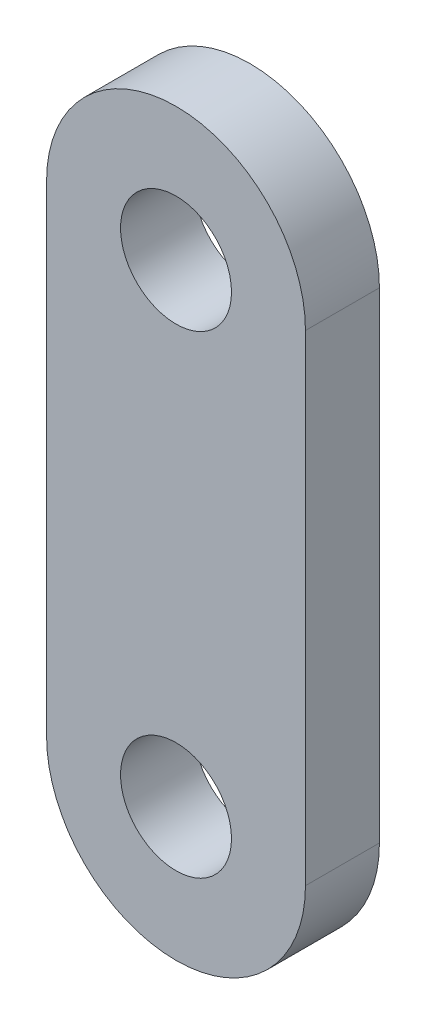
ISO-10303-21;
HEADER;
FILE_DESCRIPTION(('STEP AP214'),'2;1');
FILE_NAME('part.step','',(''),(''),'','','');
FILE_SCHEMA(('AUTOMOTIVE_DESIGN { 1 0 10303 214 1 1 1 1 }'));
ENDSEC;
DATA;
#1=APPLICATION_CONTEXT('core data for automotive mechanical design processes');
#2=APPLICATION_PROTOCOL_DEFINITION('international standard','automotive_design',2000,#1);
#3=PRODUCT_CONTEXT('',#1,'mechanical');
#4=PRODUCT('Part','Part','',(#3));
#5=PRODUCT_RELATED_PRODUCT_CATEGORY('part','',(#4));
#6=PRODUCT_DEFINITION_FORMATION('','',#4);
#7=PRODUCT_DEFINITION_CONTEXT('part definition',#1,'design');
#8=PRODUCT_DEFINITION('design','',#6,#7);
#9=PRODUCT_DEFINITION_SHAPE('','',#8);
#10=(LENGTH_UNIT() NAMED_UNIT(*) SI_UNIT(.MILLI.,.METRE.));
#11=(NAMED_UNIT(*) PLANE_ANGLE_UNIT() SI_UNIT($,.RADIAN.));
#12=(NAMED_UNIT(*) SI_UNIT($,.STERADIAN.) SOLID_ANGLE_UNIT());
#13=UNCERTAINTY_MEASURE_WITH_UNIT(LENGTH_MEASURE(1.E-05),#10,'distance_accuracy_value','');
#14=(GEOMETRIC_REPRESENTATION_CONTEXT(3) GLOBAL_UNCERTAINTY_ASSIGNED_CONTEXT((#13)) GLOBAL_UNIT_ASSIGNED_CONTEXT((#10,
#11,#12)) REPRESENTATION_CONTEXT('',''));
#15=CARTESIAN_POINT('',(0.,0.,0.));
#16=DIRECTION('',(0.,0.,1.));
#17=DIRECTION('',(1.,0.,0.));
#18=AXIS2_PLACEMENT_3D('',#15,#16,#17);
#19=CARTESIAN_POINT('',(0.,-10.31875,-1.5875));
#20=DIRECTION('',(0.,0.,-1.));
#21=DIRECTION('',(-1.,0.,0.));
#22=AXIS2_PLACEMENT_3D('',#19,#20,#21);
#23=CYLINDRICAL_SURFACE('',#22,5.55625);
#24=DIRECTION('',(0.,0.,-1.));
#25=VECTOR('',#24,1.);
#26=CARTESIAN_POINT('',(-5.55625,-10.31875,1.5875));
#27=LINE('',#26,#25);
#28=CARTESIAN_POINT('',(-5.55625,-10.31875,-1.5875));
#29=VERTEX_POINT('',#28);
#30=CARTESIAN_POINT('',(-5.55625,-10.31875,1.5875));
#31=VERTEX_POINT('',#30);
#32=EDGE_CURVE('E86',#29,#31,#27,.F.);
#33=ORIENTED_EDGE('',*,*,#32,.F.);
#34=CARTESIAN_POINT('',(0.,-10.31875,-1.5875));
#35=DIRECTION('',(0.,0.,1.));
#36=DIRECTION('',(1.,0.,0.));
#37=AXIS2_PLACEMENT_3D('',#34,#35,#36);
#38=CIRCLE('',#37,5.55625);
#39=CARTESIAN_POINT('',(5.55625,-10.31875,-1.5875));
#40=VERTEX_POINT('',#39);
#41=EDGE_CURVE('E44',#40,#29,#38,.F.);
#42=ORIENTED_EDGE('',*,*,#41,.F.);
#43=DIRECTION('',(0.,0.,-1.));
#44=VECTOR('',#43,1.);
#45=CARTESIAN_POINT('',(5.55625,-10.31875,1.5875));
#46=LINE('',#45,#44);
#47=CARTESIAN_POINT('',(5.55625,-10.31875,1.5875));
#48=VERTEX_POINT('',#47);
#49=EDGE_CURVE('E111',#48,#40,#46,.T.);
#50=ORIENTED_EDGE('',*,*,#49,.F.);
#51=CARTESIAN_POINT('',(0.,-10.31875,1.5875));
#52=DIRECTION('',(0.,0.,1.));
#53=DIRECTION('',(1.,0.,0.));
#54=AXIS2_PLACEMENT_3D('',#51,#52,#53);
#55=CIRCLE('',#54,5.55625);
#56=EDGE_CURVE('E11',#31,#48,#55,.T.);
#57=ORIENTED_EDGE('',*,*,#56,.F.);
#58=EDGE_LOOP('',(#33,#42,#50,#57));
#59=FACE_BOUND('',#58,.T.);
#60=ADVANCED_FACE('F36',(#59),#23,.T.);
#61=CARTESIAN_POINT('',(0.,10.31875,1.5875));
#62=DIRECTION('',(0.,0.,-1.));
#63=DIRECTION('',(-1.,0.,0.));
#64=AXIS2_PLACEMENT_3D('',#61,#62,#63);
#65=CYLINDRICAL_SURFACE('',#64,5.55625);
#66=DIRECTION('',(0.,0.,-1.));
#67=VECTOR('',#66,1.);
#68=CARTESIAN_POINT('',(-5.55625,10.31875,1.5875));
#69=LINE('',#68,#67);
#70=CARTESIAN_POINT('',(-5.55625,10.31875,1.5875));
#71=VERTEX_POINT('',#70);
#72=CARTESIAN_POINT('',(-5.55625,10.31875,-1.5875));
#73=VERTEX_POINT('',#72);
#74=EDGE_CURVE('E79',#71,#73,#69,.T.);
#75=ORIENTED_EDGE('',*,*,#74,.F.);
#76=CARTESIAN_POINT('',(0.,10.31875,1.5875));
#77=DIRECTION('',(0.,0.,1.));
#78=DIRECTION('',(1.,0.,0.));
#79=AXIS2_PLACEMENT_3D('',#76,#77,#78);
#80=CIRCLE('',#79,5.55625);
#81=CARTESIAN_POINT('',(5.55625,10.31875,1.5875));
#82=VERTEX_POINT('',#81);
#83=EDGE_CURVE('E87',#82,#71,#80,.T.);
#84=ORIENTED_EDGE('',*,*,#83,.F.);
#85=DIRECTION('',(0.,0.,-1.));
#86=VECTOR('',#85,1.);
#87=CARTESIAN_POINT('',(5.55625,10.31875,1.5875));
#88=LINE('',#87,#86);
#89=CARTESIAN_POINT('',(5.55625,10.31875,-1.5875));
#90=VERTEX_POINT('',#89);
#91=EDGE_CURVE('E82',#90,#82,#88,.F.);
#92=ORIENTED_EDGE('',*,*,#91,.F.);
#93=CARTESIAN_POINT('',(0.,10.31875,-1.5875));
#94=DIRECTION('',(0.,0.,1.));
#95=DIRECTION('',(1.,0.,0.));
#96=AXIS2_PLACEMENT_3D('',#93,#94,#95);
#97=CIRCLE('',#96,5.55625);
#98=EDGE_CURVE('E75',#73,#90,#97,.F.);
#99=ORIENTED_EDGE('',*,*,#98,.F.);
#100=EDGE_LOOP('',(#75,#84,#92,#99));
#101=FACE_BOUND('',#100,.T.);
#102=ADVANCED_FACE('F77',(#101),#65,.T.);
#103=CARTESIAN_POINT('',(-5.55625,-15.875,1.5875));
#104=DIRECTION('',(1.,0.,0.));
#105=DIRECTION('',(0.,0.,-1.));
#106=AXIS2_PLACEMENT_3D('',#103,#104,#105);
#107=PLANE('',#106);
#108=DIRECTION('',(0.,-1.,0.));
#109=VECTOR('',#108,1.);
#110=CARTESIAN_POINT('',(-5.55625,-15.875,-1.5875));
#111=LINE('',#110,#109);
#112=EDGE_CURVE('E93',#73,#29,#111,.T.);
#113=ORIENTED_EDGE('',*,*,#112,.T.);
#114=ORIENTED_EDGE('',*,*,#32,.T.);
#115=DIRECTION('',(0.,-1.,0.));
#116=VECTOR('',#115,1.);
#117=CARTESIAN_POINT('',(-5.55625,-15.875,1.5875));
#118=LINE('',#117,#116);
#119=EDGE_CURVE('E94',#71,#31,#118,.T.);
#120=ORIENTED_EDGE('',*,*,#119,.F.);
#121=ORIENTED_EDGE('',*,*,#74,.T.);
#122=EDGE_LOOP('',(#113,#114,#120,#121));
#123=FACE_BOUND('',#122,.T.);
#124=ADVANCED_FACE('F91',(#123),#107,.F.);
#125=CARTESIAN_POINT('',(5.55625,-15.875,1.5875));
#126=DIRECTION('',(-1.,0.,0.));
#127=DIRECTION('',(0.,0.,1.));
#128=AXIS2_PLACEMENT_3D('',#125,#126,#127);
#129=PLANE('',#128);
#130=DIRECTION('',(0.,1.,0.));
#131=VECTOR('',#130,1.);
#132=CARTESIAN_POINT('',(5.55625,-15.875,1.5875));
#133=LINE('',#132,#131);
#134=EDGE_CURVE('E95',#48,#82,#133,.T.);
#135=ORIENTED_EDGE('',*,*,#134,.F.);
#136=ORIENTED_EDGE('',*,*,#49,.T.);
#137=DIRECTION('',(0.,1.,0.));
#138=VECTOR('',#137,1.);
#139=CARTESIAN_POINT('',(5.55625,-15.875,-1.5875));
#140=LINE('',#139,#138);
#141=EDGE_CURVE('E98',#40,#90,#140,.T.);
#142=ORIENTED_EDGE('',*,*,#141,.T.);
#143=ORIENTED_EDGE('',*,*,#91,.T.);
#144=EDGE_LOOP('',(#135,#136,#142,#143));
#145=FACE_BOUND('',#144,.T.);
#146=ADVANCED_FACE('F114',(#145),#129,.F.);
#147=CARTESIAN_POINT('',(0.,0.,1.5875));
#148=DIRECTION('',(0.,0.,1.));
#149=DIRECTION('',(1.,0.,0.));
#150=AXIS2_PLACEMENT_3D('',#147,#148,#149);
#151=PLANE('',#150);
#152=CARTESIAN_POINT('',(0.,10.16,1.5875));
#153=DIRECTION('',(0.,0.,1.));
#154=DIRECTION('',(1.,0.,0.));
#155=AXIS2_PLACEMENT_3D('',#152,#153,#154);
#156=CIRCLE('',#155,2.38125);
#157=CARTESIAN_POINT('',(2.38125,10.16,1.5875));
#158=VERTEX_POINT('',#157);
#159=EDGE_CURVE('E122',#158,#158,#156,.T.);
#160=ORIENTED_EDGE('',*,*,#159,.F.);
#161=EDGE_LOOP('',(#160));
#162=FACE_BOUND('',#161,.T.);
#163=CARTESIAN_POINT('',(0.,-10.16,1.5875));
#164=DIRECTION('',(0.,0.,1.));
#165=DIRECTION('',(1.,0.,0.));
#166=AXIS2_PLACEMENT_3D('',#163,#164,#165);
#167=CIRCLE('',#166,2.38125);
#168=CARTESIAN_POINT('',(2.38125,-10.16,1.5875));
#169=VERTEX_POINT('',#168);
#170=EDGE_CURVE('E103',#169,#169,#167,.T.);
#171=ORIENTED_EDGE('',*,*,#170,.F.);
#172=EDGE_LOOP('',(#171));
#173=FACE_BOUND('',#172,.T.);
#174=ORIENTED_EDGE('',*,*,#119,.T.);
#175=ORIENTED_EDGE('',*,*,#56,.T.);
#176=ORIENTED_EDGE('',*,*,#134,.T.);
#177=ORIENTED_EDGE('',*,*,#83,.T.);
#178=EDGE_LOOP('',(#174,#175,#176,#177));
#179=FACE_BOUND('',#178,.T.);
#180=ADVANCED_FACE('F115',(#162,#173,#179),#151,.T.);
#181=CARTESIAN_POINT('',(0.,0.,-1.5875));
#182=DIRECTION('',(0.,0.,1.));
#183=DIRECTION('',(1.,0.,0.));
#184=AXIS2_PLACEMENT_3D('',#181,#182,#183);
#185=PLANE('',#184);
#186=CARTESIAN_POINT('',(0.,10.16,-1.5875));
#187=DIRECTION('',(0.,0.,1.));
#188=DIRECTION('',(1.,0.,0.));
#189=AXIS2_PLACEMENT_3D('',#186,#187,#188);
#190=CIRCLE('',#189,2.38125);
#191=CARTESIAN_POINT('',(2.38125,10.16,-1.5875));
#192=VERTEX_POINT('',#191);
#193=EDGE_CURVE('E119',#192,#192,#190,.T.);
#194=ORIENTED_EDGE('',*,*,#193,.T.);
#195=EDGE_LOOP('',(#194));
#196=FACE_BOUND('',#195,.T.);
#197=CARTESIAN_POINT('',(0.,-10.16,-1.5875));
#198=DIRECTION('',(0.,0.,1.));
#199=DIRECTION('',(1.,0.,0.));
#200=AXIS2_PLACEMENT_3D('',#197,#198,#199);
#201=CIRCLE('',#200,2.38125);
#202=CARTESIAN_POINT('',(2.38125,-10.16,-1.5875));
#203=VERTEX_POINT('',#202);
#204=EDGE_CURVE('E99',#203,#203,#201,.T.);
#205=ORIENTED_EDGE('',*,*,#204,.T.);
#206=EDGE_LOOP('',(#205));
#207=FACE_BOUND('',#206,.T.);
#208=ORIENTED_EDGE('',*,*,#141,.F.);
#209=ORIENTED_EDGE('',*,*,#41,.T.);
#210=ORIENTED_EDGE('',*,*,#112,.F.);
#211=ORIENTED_EDGE('',*,*,#98,.T.);
#212=EDGE_LOOP('',(#208,#209,#210,#211));
#213=FACE_BOUND('',#212,.T.);
#214=ADVANCED_FACE('F97',(#196,#207,#213),#185,.F.);
#215=CARTESIAN_POINT('',(0.,-10.16,1.5875));
#216=DIRECTION('',(0.,0.,1.));
#217=DIRECTION('',(1.,0.,0.));
#218=AXIS2_PLACEMENT_3D('',#215,#216,#217);
#219=CYLINDRICAL_SURFACE('',#218,2.38125);
#220=ORIENTED_EDGE('',*,*,#204,.F.);
#221=EDGE_LOOP('',(#220));
#222=FACE_BOUND('',#221,.T.);
#223=ORIENTED_EDGE('',*,*,#170,.T.);
#224=EDGE_LOOP('',(#223));
#225=FACE_BOUND('',#224,.T.);
#226=ADVANCED_FACE('F133',(#222,#225),#219,.F.);
#227=CARTESIAN_POINT('',(0.,10.16,1.5875));
#228=DIRECTION('',(0.,0.,1.));
#229=DIRECTION('',(1.,0.,0.));
#230=AXIS2_PLACEMENT_3D('',#227,#228,#229);
#231=CYLINDRICAL_SURFACE('',#230,2.38125);
#232=ORIENTED_EDGE('',*,*,#193,.F.);
#233=EDGE_LOOP('',(#232));
#234=FACE_BOUND('',#233,.T.);
#235=ORIENTED_EDGE('',*,*,#159,.T.);
#236=EDGE_LOOP('',(#235));
#237=FACE_BOUND('',#236,.T.);
#238=ADVANCED_FACE('F126',(#234,#237),#231,.F.);
#239=CLOSED_SHELL('',(#60,#102,#124,#146,#180,#214,#226,#238));
#240=MANIFOLD_SOLID_BREP('B2',#239);
#241=ADVANCED_BREP_SHAPE_REPRESENTATION('',(#18,#240),#14);
#242=SHAPE_DEFINITION_REPRESENTATION(#9,#241);
ENDSEC;
END-ISO-10303-21;
